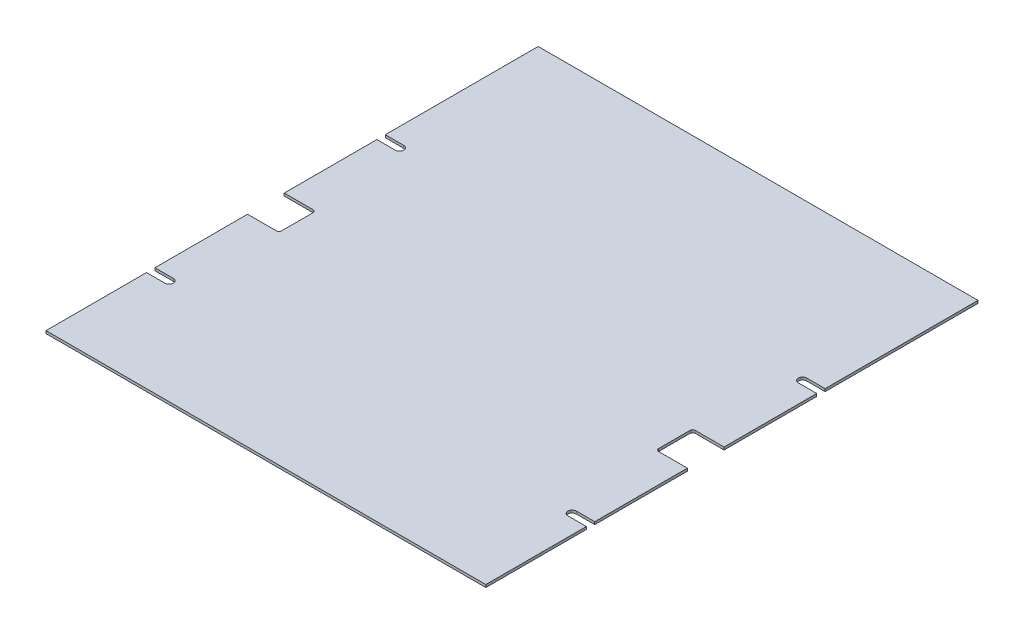
ISO-10303-21;
HEADER;
FILE_DESCRIPTION(('STEP AP214'),'2;1');
FILE_NAME('part.step','',(''),(''),'','','');
FILE_SCHEMA(('AUTOMOTIVE_DESIGN { 1 0 10303 214 1 1 1 1 }'));
ENDSEC;
DATA;
#1=APPLICATION_CONTEXT('core data for automotive mechanical design processes');
#2=APPLICATION_PROTOCOL_DEFINITION('international standard','automotive_design',2000,#1);
#3=PRODUCT_CONTEXT('',#1,'mechanical');
#4=PRODUCT('Part','Part','',(#3));
#5=PRODUCT_RELATED_PRODUCT_CATEGORY('part','',(#4));
#6=PRODUCT_DEFINITION_FORMATION('','',#4);
#7=PRODUCT_DEFINITION_CONTEXT('part definition',#1,'design');
#8=PRODUCT_DEFINITION('design','',#6,#7);
#9=PRODUCT_DEFINITION_SHAPE('','',#8);
#10=(LENGTH_UNIT() NAMED_UNIT(*) SI_UNIT(.MILLI.,.METRE.));
#11=(NAMED_UNIT(*) PLANE_ANGLE_UNIT() SI_UNIT($,.RADIAN.));
#12=(NAMED_UNIT(*) SI_UNIT($,.STERADIAN.) SOLID_ANGLE_UNIT());
#13=UNCERTAINTY_MEASURE_WITH_UNIT(LENGTH_MEASURE(1.E-05),#10,'distance_accuracy_value','');
#14=(GEOMETRIC_REPRESENTATION_CONTEXT(3) GLOBAL_UNCERTAINTY_ASSIGNED_CONTEXT((#13)) GLOBAL_UNIT_ASSIGNED_CONTEXT((#10,
#11,#12)) REPRESENTATION_CONTEXT('',''));
#15=CARTESIAN_POINT('',(0.,0.,0.));
#16=DIRECTION('',(0.,0.,1.));
#17=DIRECTION('',(1.,0.,0.));
#18=AXIS2_PLACEMENT_3D('',#15,#16,#17);
#19=CARTESIAN_POINT('',(266.7,3.175,298.45));
#20=DIRECTION('',(-1.,0.,0.));
#21=DIRECTION('',(0.,0.,1.));
#22=AXIS2_PLACEMENT_3D('',#19,#20,#21);
#23=PLANE('',#22);
#24=DIRECTION('',(0.,0.,-1.));
#25=VECTOR('',#24,1.);
#26=CARTESIAN_POINT('',(266.7,3.175,298.45));
#27=LINE('',#26,#25);
#28=CARTESIAN_POINT('',(266.7,3.175,166.370000343312));
#29=VERTEX_POINT('',#28);
#30=CARTESIAN_POINT('',(266.7,3.175,53.9749999999998));
#31=VERTEX_POINT('',#30);
#32=EDGE_CURVE('E271',#29,#31,#27,.T.);
#33=ORIENTED_EDGE('',*,*,#32,.F.);
#34=DIRECTION('',(0.,-1.,0.));
#35=VECTOR('',#34,1.);
#36=CARTESIAN_POINT('',(266.7,3.175,166.370000343312));
#37=LINE('',#36,#35);
#38=CARTESIAN_POINT('',(266.7,0.,166.370000343312));
#39=VERTEX_POINT('',#38);
#40=EDGE_CURVE('E452',#29,#39,#37,.T.);
#41=ORIENTED_EDGE('',*,*,#40,.T.);
#42=DIRECTION('',(0.,0.,-1.));
#43=VECTOR('',#42,1.);
#44=CARTESIAN_POINT('',(266.7,0.,298.45));
#45=LINE('',#44,#43);
#46=CARTESIAN_POINT('',(266.7,0.,53.9749999999998));
#47=VERTEX_POINT('',#46);
#48=EDGE_CURVE('E298',#39,#47,#45,.T.);
#49=ORIENTED_EDGE('',*,*,#48,.T.);
#50=DIRECTION('',(0.,-1.,0.));
#51=VECTOR('',#50,1.);
#52=CARTESIAN_POINT('',(266.7,3.175,53.9749999999998));
#53=LINE('',#52,#51);
#54=EDGE_CURVE('E369',#31,#47,#53,.T.);
#55=ORIENTED_EDGE('',*,*,#54,.F.);
#56=EDGE_LOOP('',(#33,#41,#49,#55));
#57=FACE_BOUND('',#56,.T.);
#58=ADVANCED_FACE('F33',(#57),#23,.F.);
#59=CARTESIAN_POINT('',(-266.7,3.175,298.45));
#60=DIRECTION('',(1.,0.,0.));
#61=DIRECTION('',(0.,0.,-1.));
#62=AXIS2_PLACEMENT_3D('',#59,#60,#61);
#63=PLANE('',#62);
#64=DIRECTION('',(0.,0.,1.));
#65=VECTOR('',#64,1.);
#66=CARTESIAN_POINT('',(-266.7,3.175,298.45));
#67=LINE('',#66,#65);
#68=CARTESIAN_POINT('',(-266.7,3.175,176.530000343312));
#69=VERTEX_POINT('',#68);
#70=CARTESIAN_POINT('',(-266.7,3.175,298.45));
#71=VERTEX_POINT('',#70);
#72=EDGE_CURVE('E282',#69,#71,#67,.T.);
#73=ORIENTED_EDGE('',*,*,#72,.F.);
#74=DIRECTION('',(0.,-1.,0.));
#75=VECTOR('',#74,1.);
#76=CARTESIAN_POINT('',(-266.7,3.175,176.530000343312));
#77=LINE('',#76,#75);
#78=CARTESIAN_POINT('',(-266.7,0.,176.530000343312));
#79=VERTEX_POINT('',#78);
#80=EDGE_CURVE('E407',#69,#79,#77,.T.);
#81=ORIENTED_EDGE('',*,*,#80,.T.);
#82=DIRECTION('',(0.,0.,1.));
#83=VECTOR('',#82,1.);
#84=CARTESIAN_POINT('',(-266.7,0.,298.45));
#85=LINE('',#84,#83);
#86=CARTESIAN_POINT('',(-266.7,0.,298.45));
#87=VERTEX_POINT('',#86);
#88=EDGE_CURVE('E300',#79,#87,#85,.T.);
#89=ORIENTED_EDGE('',*,*,#88,.T.);
#90=DIRECTION('',(0.,-1.,0.));
#91=VECTOR('',#90,1.);
#92=CARTESIAN_POINT('',(-266.7,3.175,298.45));
#93=LINE('',#92,#91);
#94=EDGE_CURVE('E309',#71,#87,#93,.T.);
#95=ORIENTED_EDGE('',*,*,#94,.F.);
#96=EDGE_LOOP('',(#73,#81,#89,#95));
#97=FACE_BOUND('',#96,.T.);
#98=ADVANCED_FACE('F521',(#97),#63,.F.);
#99=CARTESIAN_POINT('',(266.7,3.175,-113.030000343312));
#100=VERTEX_POINT('',#99);
#101=CARTESIAN_POINT('',(266.7,3.175,-298.45));
#102=VERTEX_POINT('',#101);
#103=EDGE_CURVE('E272',#100,#102,#27,.T.);
#104=ORIENTED_EDGE('',*,*,#103,.F.);
#105=DIRECTION('',(0.,-1.,0.));
#106=VECTOR('',#105,1.);
#107=CARTESIAN_POINT('',(266.7,3.175,-113.030000343312));
#108=LINE('',#107,#106);
#109=CARTESIAN_POINT('',(266.7,0.,-113.030000343312));
#110=VERTEX_POINT('',#109);
#111=EDGE_CURVE('E423',#100,#110,#108,.T.);
#112=ORIENTED_EDGE('',*,*,#111,.T.);
#113=CARTESIAN_POINT('',(266.7,0.,-298.45));
#114=VERTEX_POINT('',#113);
#115=EDGE_CURVE('E392',#110,#114,#45,.T.);
#116=ORIENTED_EDGE('',*,*,#115,.T.);
#117=DIRECTION('',(0.,-1.,0.));
#118=VECTOR('',#117,1.);
#119=CARTESIAN_POINT('',(266.7,3.175,-298.45));
#120=LINE('',#119,#118);
#121=EDGE_CURVE('E315',#102,#114,#120,.T.);
#122=ORIENTED_EDGE('',*,*,#121,.F.);
#123=EDGE_LOOP('',(#104,#112,#116,#122));
#124=FACE_BOUND('',#123,.T.);
#125=ADVANCED_FACE('F422',(#124),#23,.F.);
#126=CARTESIAN_POINT('',(-266.7,3.175,-102.870000343312));
#127=VERTEX_POINT('',#126);
#128=CARTESIAN_POINT('',(-266.7,3.175,9.52499999999975));
#129=VERTEX_POINT('',#128);
#130=EDGE_CURVE('E288',#127,#129,#67,.T.);
#131=ORIENTED_EDGE('',*,*,#130,.F.);
#132=DIRECTION('',(0.,-1.,0.));
#133=VECTOR('',#132,1.);
#134=CARTESIAN_POINT('',(-266.7,3.175,-102.870000343312));
#135=LINE('',#134,#133);
#136=CARTESIAN_POINT('',(-266.7,0.,-102.870000343312));
#137=VERTEX_POINT('',#136);
#138=EDGE_CURVE('E455',#127,#137,#135,.T.);
#139=ORIENTED_EDGE('',*,*,#138,.T.);
#140=CARTESIAN_POINT('',(-266.7,0.,9.52499999999978));
#141=VERTEX_POINT('',#140);
#142=EDGE_CURVE('E304',#137,#141,#85,.T.);
#143=ORIENTED_EDGE('',*,*,#142,.T.);
#144=DIRECTION('',(0.,-1.,0.));
#145=VECTOR('',#144,1.);
#146=CARTESIAN_POINT('',(-266.7,3.175,9.52499999999975));
#147=LINE('',#146,#145);
#148=EDGE_CURVE('E368',#129,#141,#147,.T.);
#149=ORIENTED_EDGE('',*,*,#148,.F.);
#150=EDGE_LOOP('',(#131,#139,#143,#149));
#151=FACE_BOUND('',#150,.T.);
#152=ADVANCED_FACE('F533',(#151),#63,.F.);
#153=CARTESIAN_POINT('',(266.7,0.,298.45));
#154=VERTEX_POINT('',#153);
#155=CARTESIAN_POINT('',(266.7,0.,176.530000343312));
#156=VERTEX_POINT('',#155);
#157=EDGE_CURVE('E294',#154,#156,#45,.T.);
#158=ORIENTED_EDGE('',*,*,#157,.T.);
#159=DIRECTION('',(0.,-1.,0.));
#160=VECTOR('',#159,1.);
#161=CARTESIAN_POINT('',(266.7,3.175,176.530000343312));
#162=LINE('',#161,#160);
#163=CARTESIAN_POINT('',(266.7,3.175,176.530000343312));
#164=VERTEX_POINT('',#163);
#165=EDGE_CURVE('E56',#164,#156,#162,.T.);
#166=ORIENTED_EDGE('',*,*,#165,.F.);
#167=CARTESIAN_POINT('',(266.7,3.175,298.45));
#168=VERTEX_POINT('',#167);
#169=EDGE_CURVE('E274',#168,#164,#27,.T.);
#170=ORIENTED_EDGE('',*,*,#169,.F.);
#171=DIRECTION('',(0.,-1.,0.));
#172=VECTOR('',#171,1.);
#173=CARTESIAN_POINT('',(266.7,3.175,298.45));
#174=LINE('',#173,#172);
#175=EDGE_CURVE('E293',#168,#154,#174,.T.);
#176=ORIENTED_EDGE('',*,*,#175,.T.);
#177=EDGE_LOOP('',(#158,#166,#170,#176));
#178=FACE_BOUND('',#177,.T.);
#179=ADVANCED_FACE('F559',(#178),#23,.F.);
#180=CARTESIAN_POINT('',(-266.7,0.,53.9749999999998));
#181=VERTEX_POINT('',#180);
#182=CARTESIAN_POINT('',(-266.7,0.,166.370000343312));
#183=VERTEX_POINT('',#182);
#184=EDGE_CURVE('E305',#181,#183,#85,.T.);
#185=ORIENTED_EDGE('',*,*,#184,.T.);
#186=DIRECTION('',(0.,-1.,0.));
#187=VECTOR('',#186,1.);
#188=CARTESIAN_POINT('',(-266.7,3.175,166.370000343312));
#189=LINE('',#188,#187);
#190=CARTESIAN_POINT('',(-266.7,3.175,166.370000343312));
#191=VERTEX_POINT('',#190);
#192=EDGE_CURVE('E48',#191,#183,#189,.T.);
#193=ORIENTED_EDGE('',*,*,#192,.F.);
#194=CARTESIAN_POINT('',(-266.7,3.175,53.9749999999998));
#195=VERTEX_POINT('',#194);
#196=EDGE_CURVE('E286',#195,#191,#67,.T.);
#197=ORIENTED_EDGE('',*,*,#196,.F.);
#198=DIRECTION('',(0.,-1.,0.));
#199=VECTOR('',#198,1.);
#200=CARTESIAN_POINT('',(-266.7,3.175,53.9749999999998));
#201=LINE('',#200,#199);
#202=EDGE_CURVE('E389',#195,#181,#201,.T.);
#203=ORIENTED_EDGE('',*,*,#202,.T.);
#204=EDGE_LOOP('',(#185,#193,#197,#203));
#205=FACE_BOUND('',#204,.T.);
#206=ADVANCED_FACE('F528',(#205),#63,.F.);
#207=CARTESIAN_POINT('',(266.7,0.,9.52499999999975));
#208=VERTEX_POINT('',#207);
#209=CARTESIAN_POINT('',(266.7,0.,-102.870000343312));
#210=VERTEX_POINT('',#209);
#211=EDGE_CURVE('E263',#208,#210,#45,.T.);
#212=ORIENTED_EDGE('',*,*,#211,.T.);
#213=DIRECTION('',(0.,-1.,0.));
#214=VECTOR('',#213,1.);
#215=CARTESIAN_POINT('',(266.7,3.175,-102.870000343312));
#216=LINE('',#215,#214);
#217=CARTESIAN_POINT('',(266.7,3.175,-102.870000343312));
#218=VERTEX_POINT('',#217);
#219=EDGE_CURVE('E246',#218,#210,#216,.T.);
#220=ORIENTED_EDGE('',*,*,#219,.F.);
#221=CARTESIAN_POINT('',(266.7,3.175,9.52499999999975));
#222=VERTEX_POINT('',#221);
#223=EDGE_CURVE('E261',#222,#218,#27,.T.);
#224=ORIENTED_EDGE('',*,*,#223,.F.);
#225=DIRECTION('',(0.,-1.,0.));
#226=VECTOR('',#225,1.);
#227=CARTESIAN_POINT('',(266.7,3.175,9.52499999999975));
#228=LINE('',#227,#226);
#229=EDGE_CURVE('E402',#222,#208,#228,.T.);
#230=ORIENTED_EDGE('',*,*,#229,.T.);
#231=EDGE_LOOP('',(#212,#220,#224,#230));
#232=FACE_BOUND('',#231,.T.);
#233=ADVANCED_FACE('F259',(#232),#23,.F.);
#234=CARTESIAN_POINT('',(-266.7,3.175,-298.45));
#235=DIRECTION('',(0.,0.,1.));
#236=DIRECTION('',(1.,0.,0.));
#237=AXIS2_PLACEMENT_3D('',#234,#235,#236);
#238=PLANE('',#237);
#239=DIRECTION('',(-1.,0.,0.));
#240=VECTOR('',#239,1.);
#241=CARTESIAN_POINT('',(-266.7,0.,-298.45));
#242=LINE('',#241,#240);
#243=CARTESIAN_POINT('',(-266.7,0.,-298.45));
#244=VERTEX_POINT('',#243);
#245=EDGE_CURVE('E297',#114,#244,#242,.T.);
#246=ORIENTED_EDGE('',*,*,#245,.T.);
#247=DIRECTION('',(0.,-1.,0.));
#248=VECTOR('',#247,1.);
#249=CARTESIAN_POINT('',(-266.7,3.175,-298.45));
#250=LINE('',#249,#248);
#251=CARTESIAN_POINT('',(-266.7,3.175,-298.45));
#252=VERTEX_POINT('',#251);
#253=EDGE_CURVE('E312',#252,#244,#250,.T.);
#254=ORIENTED_EDGE('',*,*,#253,.F.);
#255=DIRECTION('',(-1.,0.,0.));
#256=VECTOR('',#255,1.);
#257=CARTESIAN_POINT('',(-266.7,3.175,-298.45));
#258=LINE('',#257,#256);
#259=EDGE_CURVE('E279',#102,#252,#258,.T.);
#260=ORIENTED_EDGE('',*,*,#259,.F.);
#261=ORIENTED_EDGE('',*,*,#121,.T.);
#262=EDGE_LOOP('',(#246,#254,#260,#261));
#263=FACE_BOUND('',#262,.T.);
#264=ADVANCED_FACE('F428',(#263),#238,.F.);
#265=CARTESIAN_POINT('',(-266.7,0.,-113.030000343312));
#266=VERTEX_POINT('',#265);
#267=EDGE_CURVE('E301',#244,#266,#85,.T.);
#268=ORIENTED_EDGE('',*,*,#267,.T.);
#269=DIRECTION('',(0.,-1.,0.));
#270=VECTOR('',#269,1.);
#271=CARTESIAN_POINT('',(-266.7,3.175,-113.030000343312));
#272=LINE('',#271,#270);
#273=CARTESIAN_POINT('',(-266.7,3.175,-113.030000343312));
#274=VERTEX_POINT('',#273);
#275=EDGE_CURVE('E433',#274,#266,#272,.T.);
#276=ORIENTED_EDGE('',*,*,#275,.F.);
#277=EDGE_CURVE('E289',#252,#274,#67,.T.);
#278=ORIENTED_EDGE('',*,*,#277,.F.);
#279=ORIENTED_EDGE('',*,*,#253,.T.);
#280=EDGE_LOOP('',(#268,#276,#278,#279));
#281=FACE_BOUND('',#280,.T.);
#282=ADVANCED_FACE('F432',(#281),#63,.F.);
#283=CARTESIAN_POINT('',(-266.7,3.175,298.45));
#284=DIRECTION('',(0.,0.,-1.));
#285=DIRECTION('',(-1.,0.,0.));
#286=AXIS2_PLACEMENT_3D('',#283,#284,#285);
#287=PLANE('',#286);
#288=DIRECTION('',(1.,0.,0.));
#289=VECTOR('',#288,1.);
#290=CARTESIAN_POINT('',(-266.7,0.,298.45));
#291=LINE('',#290,#289);
#292=EDGE_CURVE('E275',#87,#154,#291,.T.);
#293=ORIENTED_EDGE('',*,*,#292,.T.);
#294=ORIENTED_EDGE('',*,*,#175,.F.);
#295=DIRECTION('',(1.,0.,0.));
#296=VECTOR('',#295,1.);
#297=CARTESIAN_POINT('',(-266.7,3.175,298.45));
#298=LINE('',#297,#296);
#299=EDGE_CURVE('E291',#71,#168,#298,.T.);
#300=ORIENTED_EDGE('',*,*,#299,.F.);
#301=ORIENTED_EDGE('',*,*,#94,.T.);
#302=EDGE_LOOP('',(#293,#294,#300,#301));
#303=FACE_BOUND('',#302,.T.);
#304=ADVANCED_FACE('F616',(#303),#287,.F.);
#305=CARTESIAN_POINT('',(0.,3.175,0.));
#306=DIRECTION('',(0.,-1.,0.));
#307=DIRECTION('',(0.,0.,-1.));
#308=AXIS2_PLACEMENT_3D('',#305,#306,#307);
#309=PLANE('',#308);
#310=CARTESIAN_POINT('',(-244.3861,3.175,-107.950000343312));
#311=DIRECTION('',(0.,-1.,0.));
#312=DIRECTION('',(0.,0.,1.));
#313=AXIS2_PLACEMENT_3D('',#310,#311,#312);
#314=CIRCLE('',#313,5.07999999999989);
#315=CARTESIAN_POINT('',(-244.386100000001,3.175,-113.030000343312));
#316=VERTEX_POINT('',#315);
#317=CARTESIAN_POINT('',(-244.386100000001,3.175,-102.870000343312));
#318=VERTEX_POINT('',#317);
#319=EDGE_CURVE('E438',#316,#318,#314,.T.);
#320=ORIENTED_EDGE('',*,*,#319,.T.);
#321=DIRECTION('',(-1.,0.,0.));
#322=VECTOR('',#321,1.);
#323=CARTESIAN_POINT('',(-266.7,3.175,-102.870000343312));
#324=LINE('',#323,#322);
#325=EDGE_CURVE('E442',#318,#127,#324,.T.);
#326=ORIENTED_EDGE('',*,*,#325,.T.);
#327=ORIENTED_EDGE('',*,*,#130,.T.);
#328=DIRECTION('',(1.,0.,0.));
#329=VECTOR('',#328,1.);
#330=CARTESIAN_POINT('',(-228.6,3.175,9.52499999999976));
#331=LINE('',#330,#329);
#332=CARTESIAN_POINT('',(-231.775,3.175,9.52499999999976));
#333=VERTEX_POINT('',#332);
#334=EDGE_CURVE('E376',#129,#333,#331,.T.);
#335=ORIENTED_EDGE('',*,*,#334,.T.);
#336=CARTESIAN_POINT('',(-231.775,3.175,12.6999999999998));
#337=DIRECTION('',(0.,-1.,0.));
#338=DIRECTION('',(0.,0.,-1.));
#339=AXIS2_PLACEMENT_3D('',#336,#337,#338);
#340=CIRCLE('',#339,3.175);
#341=CARTESIAN_POINT('',(-228.6,3.175,12.6999999999998));
#342=VERTEX_POINT('',#341);
#343=EDGE_CURVE('E11',#333,#342,#340,.T.);
#344=ORIENTED_EDGE('',*,*,#343,.T.);
#345=DIRECTION('',(0.,0.,1.));
#346=VECTOR('',#345,1.);
#347=CARTESIAN_POINT('',(-228.6,3.175,53.9749999999998));
#348=LINE('',#347,#346);
#349=CARTESIAN_POINT('',(-228.6,3.175,50.7999999999998));
#350=VERTEX_POINT('',#349);
#351=EDGE_CURVE('E374',#342,#350,#348,.T.);
#352=ORIENTED_EDGE('',*,*,#351,.T.);
#353=CARTESIAN_POINT('',(-231.775,3.175,50.7999999999998));
#354=DIRECTION('',(0.,-1.,0.));
#355=DIRECTION('',(0.,0.,-1.));
#356=AXIS2_PLACEMENT_3D('',#353,#354,#355);
#357=CIRCLE('',#356,3.175);
#358=CARTESIAN_POINT('',(-231.775,3.175,53.9749999999998));
#359=VERTEX_POINT('',#358);
#360=EDGE_CURVE('E348',#350,#359,#357,.T.);
#361=ORIENTED_EDGE('',*,*,#360,.T.);
#362=DIRECTION('',(-1.,0.,0.));
#363=VECTOR('',#362,1.);
#364=CARTESIAN_POINT('',(-228.6,3.175,53.9749999999998));
#365=LINE('',#364,#363);
#366=EDGE_CURVE('E380',#359,#195,#365,.T.);
#367=ORIENTED_EDGE('',*,*,#366,.T.);
#368=ORIENTED_EDGE('',*,*,#196,.T.);
#369=DIRECTION('',(1.,0.,0.));
#370=VECTOR('',#369,1.);
#371=CARTESIAN_POINT('',(-266.7,3.175,166.370000343312));
#372=LINE('',#371,#370);
#373=CARTESIAN_POINT('',(-244.386100000001,3.175,166.370000343312));
#374=VERTEX_POINT('',#373);
#375=EDGE_CURVE('E486',#191,#374,#372,.T.);
#376=ORIENTED_EDGE('',*,*,#375,.T.);
#377=CARTESIAN_POINT('',(-244.386100000001,3.175,171.450000343312));
#378=DIRECTION('',(0.,-1.,0.));
#379=DIRECTION('',(0.,0.,-1.));
#380=AXIS2_PLACEMENT_3D('',#377,#378,#379);
#381=CIRCLE('',#380,5.07999999999989);
#382=CARTESIAN_POINT('',(-244.386100000001,3.175,176.530000343312));
#383=VERTEX_POINT('',#382);
#384=EDGE_CURVE('E489',#374,#383,#381,.T.);
#385=ORIENTED_EDGE('',*,*,#384,.T.);
#386=DIRECTION('',(-1.,0.,0.));
#387=VECTOR('',#386,1.);
#388=CARTESIAN_POINT('',(-266.7,3.175,176.530000343312));
#389=LINE('',#388,#387);
#390=EDGE_CURVE('E493',#383,#69,#389,.T.);
#391=ORIENTED_EDGE('',*,*,#390,.T.);
#392=ORIENTED_EDGE('',*,*,#72,.T.);
#393=ORIENTED_EDGE('',*,*,#299,.T.);
#394=ORIENTED_EDGE('',*,*,#169,.T.);
#395=DIRECTION('',(-1.,0.,0.));
#396=VECTOR('',#395,1.);
#397=CARTESIAN_POINT('',(266.7,3.175,176.530000343312));
#398=LINE('',#397,#396);
#399=CARTESIAN_POINT('',(244.386100000001,3.175,176.530000343312));
#400=VERTEX_POINT('',#399);
#401=EDGE_CURVE('E464',#164,#400,#398,.T.);
#402=ORIENTED_EDGE('',*,*,#401,.T.);
#403=CARTESIAN_POINT('',(244.386100000001,3.175,171.450000343312));
#404=DIRECTION('',(0.,-1.,0.));
#405=DIRECTION('',(0.,0.,1.));
#406=AXIS2_PLACEMENT_3D('',#403,#404,#405);
#407=CIRCLE('',#406,5.07999999999983);
#408=CARTESIAN_POINT('',(244.386100000001,3.175,166.370000343312));
#409=VERTEX_POINT('',#408);
#410=EDGE_CURVE('E466',#400,#409,#407,.T.);
#411=ORIENTED_EDGE('',*,*,#410,.T.);
#412=DIRECTION('',(1.,0.,0.));
#413=VECTOR('',#412,1.);
#414=CARTESIAN_POINT('',(266.7,3.175,166.370000343312));
#415=LINE('',#414,#413);
#416=EDGE_CURVE('E470',#409,#29,#415,.T.);
#417=ORIENTED_EDGE('',*,*,#416,.T.);
#418=ORIENTED_EDGE('',*,*,#32,.T.);
#419=DIRECTION('',(-1.,0.,0.));
#420=VECTOR('',#419,1.);
#421=CARTESIAN_POINT('',(228.6,3.175,53.9749999999998));
#422=LINE('',#421,#420);
#423=CARTESIAN_POINT('',(231.775,3.175,53.9749999999998));
#424=VERTEX_POINT('',#423);
#425=EDGE_CURVE('E399',#31,#424,#422,.T.);
#426=ORIENTED_EDGE('',*,*,#425,.T.);
#427=CARTESIAN_POINT('',(231.775,3.175,50.7999999999998));
#428=DIRECTION('',(0.,-1.,0.));
#429=DIRECTION('',(0.,0.,-1.));
#430=AXIS2_PLACEMENT_3D('',#427,#428,#429);
#431=CIRCLE('',#430,3.175);
#432=CARTESIAN_POINT('',(228.6,3.175,50.7999999999998));
#433=VERTEX_POINT('',#432);
#434=EDGE_CURVE('E340',#424,#433,#431,.T.);
#435=ORIENTED_EDGE('',*,*,#434,.T.);
#436=DIRECTION('',(0.,0.,-1.));
#437=VECTOR('',#436,1.);
#438=CARTESIAN_POINT('',(228.6,3.175,53.9749999999998));
#439=LINE('',#438,#437);
#440=CARTESIAN_POINT('',(228.6,3.175,12.6999999999998));
#441=VERTEX_POINT('',#440);
#442=EDGE_CURVE('E394',#433,#441,#439,.T.);
#443=ORIENTED_EDGE('',*,*,#442,.T.);
#444=CARTESIAN_POINT('',(231.775,3.175,12.6999999999998));
#445=DIRECTION('',(0.,-1.,0.));
#446=DIRECTION('',(0.,0.,-1.));
#447=AXIS2_PLACEMENT_3D('',#444,#445,#446);
#448=CIRCLE('',#447,3.175);
#449=CARTESIAN_POINT('',(231.775,3.175,9.52499999999981));
#450=VERTEX_POINT('',#449);
#451=EDGE_CURVE('E344',#441,#450,#448,.T.);
#452=ORIENTED_EDGE('',*,*,#451,.T.);
#453=DIRECTION('',(1.,0.,0.));
#454=VECTOR('',#453,1.);
#455=CARTESIAN_POINT('',(228.6,3.175,9.52499999999981));
#456=LINE('',#455,#454);
#457=EDGE_CURVE('E269',#450,#222,#456,.T.);
#458=ORIENTED_EDGE('',*,*,#457,.T.);
#459=ORIENTED_EDGE('',*,*,#223,.T.);
#460=DIRECTION('',(-1.,0.,0.));
#461=VECTOR('',#460,1.);
#462=CARTESIAN_POINT('',(266.7,3.175,-102.870000343312));
#463=LINE('',#462,#461);
#464=CARTESIAN_POINT('',(244.386100000001,3.175,-102.870000343312));
#465=VERTEX_POINT('',#464);
#466=EDGE_CURVE('E242',#218,#465,#463,.T.);
#467=ORIENTED_EDGE('',*,*,#466,.T.);
#468=CARTESIAN_POINT('',(244.386100000001,3.175,-107.950000343312));
#469=DIRECTION('',(0.,-1.,0.));
#470=DIRECTION('',(0.,0.,-1.));
#471=AXIS2_PLACEMENT_3D('',#468,#469,#470);
#472=CIRCLE('',#471,5.07999999999983);
#473=CARTESIAN_POINT('',(244.386100000001,3.175,-113.030000343312));
#474=VERTEX_POINT('',#473);
#475=EDGE_CURVE('E253',#465,#474,#472,.T.);
#476=ORIENTED_EDGE('',*,*,#475,.T.);
#477=DIRECTION('',(1.,0.,0.));
#478=VECTOR('',#477,1.);
#479=CARTESIAN_POINT('',(266.7,3.175,-113.030000343312));
#480=LINE('',#479,#478);
#481=EDGE_CURVE('E264',#474,#100,#480,.T.);
#482=ORIENTED_EDGE('',*,*,#481,.T.);
#483=ORIENTED_EDGE('',*,*,#103,.T.);
#484=ORIENTED_EDGE('',*,*,#259,.T.);
#485=ORIENTED_EDGE('',*,*,#277,.T.);
#486=DIRECTION('',(1.,0.,0.));
#487=VECTOR('',#486,1.);
#488=CARTESIAN_POINT('',(-266.7,3.175,-113.030000343312));
#489=LINE('',#488,#487);
#490=EDGE_CURVE('E435',#274,#316,#489,.T.);
#491=ORIENTED_EDGE('',*,*,#490,.T.);
#492=EDGE_LOOP('',(#320,#326,#327,#335,#344,#352,#361,#367,#368,#376,#385,#391,#392,#393,#394,
#402,#411,#417,#418,#426,#435,#443,#452,#458,#459,#467,#476,#482,#483,#484,#485,#491));
#493=FACE_BOUND('',#492,.T.);
#494=ADVANCED_FACE('F267',(#493),#309,.F.);
#495=CARTESIAN_POINT('',(0.,0.,0.));
#496=DIRECTION('',(0.,-1.,0.));
#497=DIRECTION('',(0.,0.,-1.));
#498=AXIS2_PLACEMENT_3D('',#495,#496,#497);
#499=PLANE('',#498);
#500=DIRECTION('',(-1.,0.,0.));
#501=VECTOR('',#500,1.);
#502=CARTESIAN_POINT('',(-266.7,0.,-102.870000343312));
#503=LINE('',#502,#501);
#504=CARTESIAN_POINT('',(-244.386100000001,0.,-102.870000343312));
#505=VERTEX_POINT('',#504);
#506=EDGE_CURVE('E440',#505,#137,#503,.T.);
#507=ORIENTED_EDGE('',*,*,#506,.F.);
#508=CARTESIAN_POINT('',(-244.3861,0.,-107.950000343312));
#509=DIRECTION('',(0.,-1.,0.));
#510=DIRECTION('',(0.,0.,1.));
#511=AXIS2_PLACEMENT_3D('',#508,#509,#510);
#512=CIRCLE('',#511,5.07999999999989);
#513=CARTESIAN_POINT('',(-244.386100000001,0.,-113.030000343312));
#514=VERTEX_POINT('',#513);
#515=EDGE_CURVE('E444',#514,#505,#512,.T.);
#516=ORIENTED_EDGE('',*,*,#515,.F.);
#517=DIRECTION('',(1.,0.,0.));
#518=VECTOR('',#517,1.);
#519=CARTESIAN_POINT('',(-266.7,0.,-113.030000343312));
#520=LINE('',#519,#518);
#521=EDGE_CURVE('E449',#266,#514,#520,.T.);
#522=ORIENTED_EDGE('',*,*,#521,.F.);
#523=ORIENTED_EDGE('',*,*,#267,.F.);
#524=ORIENTED_EDGE('',*,*,#245,.F.);
#525=ORIENTED_EDGE('',*,*,#115,.F.);
#526=DIRECTION('',(1.,0.,0.));
#527=VECTOR('',#526,1.);
#528=CARTESIAN_POINT('',(266.7,0.,-113.030000343312));
#529=LINE('',#528,#527);
#530=CARTESIAN_POINT('',(244.386100000001,0.,-113.030000343312));
#531=VERTEX_POINT('',#530);
#532=EDGE_CURVE('E254',#531,#110,#529,.T.);
#533=ORIENTED_EDGE('',*,*,#532,.F.);
#534=CARTESIAN_POINT('',(244.386100000001,0.,-107.950000343312));
#535=DIRECTION('',(0.,-1.,0.));
#536=DIRECTION('',(0.,0.,-1.));
#537=AXIS2_PLACEMENT_3D('',#534,#535,#536);
#538=CIRCLE('',#537,5.07999999999983);
#539=CARTESIAN_POINT('',(244.386100000001,0.,-102.870000343312));
#540=VERTEX_POINT('',#539);
#541=EDGE_CURVE('E851',#540,#531,#538,.T.);
#542=ORIENTED_EDGE('',*,*,#541,.F.);
#543=DIRECTION('',(-1.,0.,0.));
#544=VECTOR('',#543,1.);
#545=CARTESIAN_POINT('',(266.7,0.,-102.870000343312));
#546=LINE('',#545,#544);
#547=EDGE_CURVE('E415',#210,#540,#546,.T.);
#548=ORIENTED_EDGE('',*,*,#547,.F.);
#549=ORIENTED_EDGE('',*,*,#211,.F.);
#550=DIRECTION('',(1.,0.,0.));
#551=VECTOR('',#550,1.);
#552=CARTESIAN_POINT('',(228.6,0.,9.52499999999981));
#553=LINE('',#552,#551);
#554=CARTESIAN_POINT('',(231.775,0.,9.52499999999981));
#555=VERTEX_POINT('',#554);
#556=EDGE_CURVE('E406',#555,#208,#553,.T.);
#557=ORIENTED_EDGE('',*,*,#556,.F.);
#558=CARTESIAN_POINT('',(231.775,0.,12.6999999999998));
#559=DIRECTION('',(0.,-1.,0.));
#560=DIRECTION('',(0.,0.,-1.));
#561=AXIS2_PLACEMENT_3D('',#558,#559,#560);
#562=CIRCLE('',#561,3.175);
#563=CARTESIAN_POINT('',(228.6,0.,12.6999999999998));
#564=VERTEX_POINT('',#563);
#565=EDGE_CURVE('E342',#555,#564,#562,.F.);
#566=ORIENTED_EDGE('',*,*,#565,.T.);
#567=DIRECTION('',(0.,0.,-1.));
#568=VECTOR('',#567,1.);
#569=CARTESIAN_POINT('',(228.6,0.,53.9749999999998));
#570=LINE('',#569,#568);
#571=CARTESIAN_POINT('',(228.6,0.,50.7999999999998));
#572=VERTEX_POINT('',#571);
#573=EDGE_CURVE('E403',#572,#564,#570,.T.);
#574=ORIENTED_EDGE('',*,*,#573,.F.);
#575=CARTESIAN_POINT('',(231.775,0.,50.7999999999998));
#576=DIRECTION('',(0.,-1.,0.));
#577=DIRECTION('',(0.,0.,-1.));
#578=AXIS2_PLACEMENT_3D('',#575,#576,#577);
#579=CIRCLE('',#578,3.175);
#580=CARTESIAN_POINT('',(231.775,0.,53.9749999999998));
#581=VERTEX_POINT('',#580);
#582=EDGE_CURVE('E338',#572,#581,#579,.F.);
#583=ORIENTED_EDGE('',*,*,#582,.T.);
#584=DIRECTION('',(-1.,0.,0.));
#585=VECTOR('',#584,1.);
#586=CARTESIAN_POINT('',(228.6,0.,53.9749999999998));
#587=LINE('',#586,#585);
#588=EDGE_CURVE('E397',#47,#581,#587,.T.);
#589=ORIENTED_EDGE('',*,*,#588,.F.);
#590=ORIENTED_EDGE('',*,*,#48,.F.);
#591=DIRECTION('',(1.,0.,0.));
#592=VECTOR('',#591,1.);
#593=CARTESIAN_POINT('',(266.7,0.,166.370000343312));
#594=LINE('',#593,#592);
#595=CARTESIAN_POINT('',(244.386100000001,0.,166.370000343312));
#596=VERTEX_POINT('',#595);
#597=EDGE_CURVE('E467',#596,#39,#594,.T.);
#598=ORIENTED_EDGE('',*,*,#597,.F.);
#599=CARTESIAN_POINT('',(244.386100000001,0.,171.450000343312));
#600=DIRECTION('',(0.,-1.,0.));
#601=DIRECTION('',(0.,0.,1.));
#602=AXIS2_PLACEMENT_3D('',#599,#600,#601);
#603=CIRCLE('',#602,5.07999999999983);
#604=CARTESIAN_POINT('',(244.386100000001,0.,176.530000343312));
#605=VERTEX_POINT('',#604);
#606=EDGE_CURVE('E475',#605,#596,#603,.T.);
#607=ORIENTED_EDGE('',*,*,#606,.F.);
#608=DIRECTION('',(-1.,0.,0.));
#609=VECTOR('',#608,1.);
#610=CARTESIAN_POINT('',(266.7,0.,176.530000343312));
#611=LINE('',#610,#609);
#612=EDGE_CURVE('E473',#156,#605,#611,.T.);
#613=ORIENTED_EDGE('',*,*,#612,.F.);
#614=ORIENTED_EDGE('',*,*,#157,.F.);
#615=ORIENTED_EDGE('',*,*,#292,.F.);
#616=ORIENTED_EDGE('',*,*,#88,.F.);
#617=DIRECTION('',(-1.,0.,0.));
#618=VECTOR('',#617,1.);
#619=CARTESIAN_POINT('',(-266.7,0.,176.530000343312));
#620=LINE('',#619,#618);
#621=CARTESIAN_POINT('',(-244.386100000001,0.,176.530000343312));
#622=VERTEX_POINT('',#621);
#623=EDGE_CURVE('E490',#622,#79,#620,.T.);
#624=ORIENTED_EDGE('',*,*,#623,.F.);
#625=CARTESIAN_POINT('',(-244.386100000001,0.,171.450000343312));
#626=DIRECTION('',(0.,-1.,0.));
#627=DIRECTION('',(0.,0.,-1.));
#628=AXIS2_PLACEMENT_3D('',#625,#626,#627);
#629=CIRCLE('',#628,5.07999999999989);
#630=CARTESIAN_POINT('',(-244.386100000001,0.,166.370000343312));
#631=VERTEX_POINT('',#630);
#632=EDGE_CURVE('E497',#631,#622,#629,.T.);
#633=ORIENTED_EDGE('',*,*,#632,.F.);
#634=DIRECTION('',(1.,0.,0.));
#635=VECTOR('',#634,1.);
#636=CARTESIAN_POINT('',(-266.7,0.,166.370000343312));
#637=LINE('',#636,#635);
#638=EDGE_CURVE('E458',#183,#631,#637,.T.);
#639=ORIENTED_EDGE('',*,*,#638,.F.);
#640=ORIENTED_EDGE('',*,*,#184,.F.);
#641=DIRECTION('',(-1.,0.,0.));
#642=VECTOR('',#641,1.);
#643=CARTESIAN_POINT('',(-228.6,0.,53.9749999999998));
#644=LINE('',#643,#642);
#645=CARTESIAN_POINT('',(-231.775,0.,53.9749999999998));
#646=VERTEX_POINT('',#645);
#647=EDGE_CURVE('E383',#646,#181,#644,.T.);
#648=ORIENTED_EDGE('',*,*,#647,.F.);
#649=CARTESIAN_POINT('',(-231.775,0.,50.7999999999998));
#650=DIRECTION('',(0.,-1.,0.));
#651=DIRECTION('',(0.,0.,-1.));
#652=AXIS2_PLACEMENT_3D('',#649,#650,#651);
#653=CIRCLE('',#652,3.175);
#654=CARTESIAN_POINT('',(-228.6,0.,50.7999999999998));
#655=VERTEX_POINT('',#654);
#656=EDGE_CURVE('E346',#646,#655,#653,.F.);
#657=ORIENTED_EDGE('',*,*,#656,.T.);
#658=DIRECTION('',(0.,0.,1.));
#659=VECTOR('',#658,1.);
#660=CARTESIAN_POINT('',(-228.6,0.,53.9749999999998));
#661=LINE('',#660,#659);
#662=CARTESIAN_POINT('',(-228.6,0.,12.6999999999998));
#663=VERTEX_POINT('',#662);
#664=EDGE_CURVE('E358',#663,#655,#661,.T.);
#665=ORIENTED_EDGE('',*,*,#664,.F.);
#666=CARTESIAN_POINT('',(-231.775,0.,12.6999999999998));
#667=DIRECTION('',(0.,-1.,0.));
#668=DIRECTION('',(0.,0.,-1.));
#669=AXIS2_PLACEMENT_3D('',#666,#667,#668);
#670=CIRCLE('',#669,3.175);
#671=CARTESIAN_POINT('',(-231.775,0.,9.52499999999976));
#672=VERTEX_POINT('',#671);
#673=EDGE_CURVE('E41',#663,#672,#670,.F.);
#674=ORIENTED_EDGE('',*,*,#673,.T.);
#675=DIRECTION('',(1.,0.,0.));
#676=VECTOR('',#675,1.);
#677=CARTESIAN_POINT('',(-228.6,0.,9.52499999999976));
#678=LINE('',#677,#676);
#679=EDGE_CURVE('E356',#141,#672,#678,.T.);
#680=ORIENTED_EDGE('',*,*,#679,.F.);
#681=ORIENTED_EDGE('',*,*,#142,.F.);
#682=EDGE_LOOP('',(#507,#516,#522,#523,#524,#525,#533,#542,#548,#549,#557,#566,#574,#583,#589,
#590,#598,#607,#613,#614,#615,#616,#624,#633,#639,#640,#648,#657,#665,#674,#680,#681));
#683=FACE_BOUND('',#682,.T.);
#684=ADVANCED_FACE('F354',(#683),#499,.T.);
#685=CARTESIAN_POINT('',(228.6,3.175,53.9749999999998));
#686=DIRECTION('',(-1.,0.,0.));
#687=DIRECTION('',(0.,0.,1.));
#688=AXIS2_PLACEMENT_3D('',#685,#686,#687);
#689=PLANE('',#688);
#690=ORIENTED_EDGE('',*,*,#442,.F.);
#691=DIRECTION('',(0.,-1.,0.));
#692=VECTOR('',#691,1.);
#693=CARTESIAN_POINT('',(228.6,0.,50.7999999999998));
#694=LINE('',#693,#692);
#695=EDGE_CURVE('E320',#433,#572,#694,.T.);
#696=ORIENTED_EDGE('',*,*,#695,.T.);
#697=ORIENTED_EDGE('',*,*,#573,.T.);
#698=DIRECTION('',(0.,-1.,0.));
#699=VECTOR('',#698,1.);
#700=CARTESIAN_POINT('',(228.6,3.175,12.6999999999998));
#701=LINE('',#700,#699);
#702=EDGE_CURVE('E318',#564,#441,#701,.F.);
#703=ORIENTED_EDGE('',*,*,#702,.T.);
#704=EDGE_LOOP('',(#690,#696,#697,#703));
#705=FACE_BOUND('',#704,.T.);
#706=ADVANCED_FACE('F593',(#705),#689,.F.);
#707=CARTESIAN_POINT('',(228.6,3.175,53.9749999999998));
#708=DIRECTION('',(0.,0.,1.));
#709=DIRECTION('',(1.,0.,0.));
#710=AXIS2_PLACEMENT_3D('',#707,#708,#709);
#711=PLANE('',#710);
#712=ORIENTED_EDGE('',*,*,#588,.T.);
#713=DIRECTION('',(0.,-1.,0.));
#714=VECTOR('',#713,1.);
#715=CARTESIAN_POINT('',(231.775,3.175,53.9749999999998));
#716=LINE('',#715,#714);
#717=EDGE_CURVE('E323',#581,#424,#716,.F.);
#718=ORIENTED_EDGE('',*,*,#717,.T.);
#719=ORIENTED_EDGE('',*,*,#425,.F.);
#720=ORIENTED_EDGE('',*,*,#54,.T.);
#721=EDGE_LOOP('',(#712,#718,#719,#720));
#722=FACE_BOUND('',#721,.T.);
#723=ADVANCED_FACE('F584',(#722),#711,.F.);
#724=CARTESIAN_POINT('',(228.6,3.175,9.52499999999981));
#725=DIRECTION('',(0.,0.,-1.));
#726=DIRECTION('',(-1.,0.,0.));
#727=AXIS2_PLACEMENT_3D('',#724,#725,#726);
#728=PLANE('',#727);
#729=ORIENTED_EDGE('',*,*,#457,.F.);
#730=DIRECTION('',(0.,-1.,0.));
#731=VECTOR('',#730,1.);
#732=CARTESIAN_POINT('',(231.775,0.,9.52499999999981));
#733=LINE('',#732,#731);
#734=EDGE_CURVE('E325',#450,#555,#733,.T.);
#735=ORIENTED_EDGE('',*,*,#734,.T.);
#736=ORIENTED_EDGE('',*,*,#556,.T.);
#737=ORIENTED_EDGE('',*,*,#229,.F.);
#738=EDGE_LOOP('',(#729,#735,#736,#737));
#739=FACE_BOUND('',#738,.T.);
#740=ADVANCED_FACE('F599',(#739),#728,.F.);
#741=CARTESIAN_POINT('',(-228.6,3.175,53.9749999999998));
#742=DIRECTION('',(0.,0.,1.));
#743=DIRECTION('',(1.,0.,0.));
#744=AXIS2_PLACEMENT_3D('',#741,#742,#743);
#745=PLANE('',#744);
#746=ORIENTED_EDGE('',*,*,#366,.F.);
#747=DIRECTION('',(0.,-1.,0.));
#748=VECTOR('',#747,1.);
#749=CARTESIAN_POINT('',(-231.775,0.,53.9749999999998));
#750=LINE('',#749,#748);
#751=EDGE_CURVE('E328',#359,#646,#750,.T.);
#752=ORIENTED_EDGE('',*,*,#751,.T.);
#753=ORIENTED_EDGE('',*,*,#647,.T.);
#754=ORIENTED_EDGE('',*,*,#202,.F.);
#755=EDGE_LOOP('',(#746,#752,#753,#754));
#756=FACE_BOUND('',#755,.T.);
#757=ADVANCED_FACE('F601',(#756),#745,.F.);
#758=CARTESIAN_POINT('',(-228.6,3.175,53.9749999999998));
#759=DIRECTION('',(1.,0.,0.));
#760=DIRECTION('',(0.,0.,-1.));
#761=AXIS2_PLACEMENT_3D('',#758,#759,#760);
#762=PLANE('',#761);
#763=ORIENTED_EDGE('',*,*,#664,.T.);
#764=DIRECTION('',(0.,-1.,0.));
#765=VECTOR('',#764,1.);
#766=CARTESIAN_POINT('',(-228.6,3.175,50.7999999999998));
#767=LINE('',#766,#765);
#768=EDGE_CURVE('E334',#655,#350,#767,.F.);
#769=ORIENTED_EDGE('',*,*,#768,.T.);
#770=ORIENTED_EDGE('',*,*,#351,.F.);
#771=DIRECTION('',(0.,-1.,0.));
#772=VECTOR('',#771,1.);
#773=CARTESIAN_POINT('',(-228.6,0.,12.6999999999998));
#774=LINE('',#773,#772);
#775=EDGE_CURVE('E331',#342,#663,#774,.T.);
#776=ORIENTED_EDGE('',*,*,#775,.T.);
#777=EDGE_LOOP('',(#763,#769,#770,#776));
#778=FACE_BOUND('',#777,.T.);
#779=ADVANCED_FACE('F378',(#778),#762,.F.);
#780=CARTESIAN_POINT('',(-228.6,3.175,9.52499999999976));
#781=DIRECTION('',(0.,0.,-1.));
#782=DIRECTION('',(-1.,0.,0.));
#783=AXIS2_PLACEMENT_3D('',#780,#781,#782);
#784=PLANE('',#783);
#785=ORIENTED_EDGE('',*,*,#679,.T.);
#786=DIRECTION('',(0.,-1.,0.));
#787=VECTOR('',#786,1.);
#788=CARTESIAN_POINT('',(-231.775,3.175,9.52499999999976));
#789=LINE('',#788,#787);
#790=EDGE_CURVE('E336',#672,#333,#789,.F.);
#791=ORIENTED_EDGE('',*,*,#790,.T.);
#792=ORIENTED_EDGE('',*,*,#334,.F.);
#793=ORIENTED_EDGE('',*,*,#148,.T.);
#794=EDGE_LOOP('',(#785,#791,#792,#793));
#795=FACE_BOUND('',#794,.T.);
#796=ADVANCED_FACE('F364',(#795),#784,.F.);
#797=CARTESIAN_POINT('',(231.775,3.175,50.7999999999998));
#798=DIRECTION('',(0.,1.,0.));
#799=DIRECTION('',(0.,0.,1.));
#800=AXIS2_PLACEMENT_3D('',#797,#798,#799);
#801=CYLINDRICAL_SURFACE('',#800,3.175);
#802=ORIENTED_EDGE('',*,*,#434,.F.);
#803=ORIENTED_EDGE('',*,*,#717,.F.);
#804=ORIENTED_EDGE('',*,*,#582,.F.);
#805=ORIENTED_EDGE('',*,*,#695,.F.);
#806=EDGE_LOOP('',(#802,#803,#804,#805));
#807=FACE_BOUND('',#806,.T.);
#808=ADVANCED_FACE('F590',(#807),#801,.F.);
#809=CARTESIAN_POINT('',(231.775,3.175,12.6999999999998));
#810=DIRECTION('',(0.,1.,0.));
#811=DIRECTION('',(0.,0.,1.));
#812=AXIS2_PLACEMENT_3D('',#809,#810,#811);
#813=CYLINDRICAL_SURFACE('',#812,3.175);
#814=ORIENTED_EDGE('',*,*,#451,.F.);
#815=ORIENTED_EDGE('',*,*,#702,.F.);
#816=ORIENTED_EDGE('',*,*,#565,.F.);
#817=ORIENTED_EDGE('',*,*,#734,.F.);
#818=EDGE_LOOP('',(#814,#815,#816,#817));
#819=FACE_BOUND('',#818,.T.);
#820=ADVANCED_FACE('F598',(#819),#813,.F.);
#821=CARTESIAN_POINT('',(-231.775,3.175,50.7999999999998));
#822=DIRECTION('',(0.,1.,0.));
#823=DIRECTION('',(0.,0.,1.));
#824=AXIS2_PLACEMENT_3D('',#821,#822,#823);
#825=CYLINDRICAL_SURFACE('',#824,3.175);
#826=ORIENTED_EDGE('',*,*,#360,.F.);
#827=ORIENTED_EDGE('',*,*,#768,.F.);
#828=ORIENTED_EDGE('',*,*,#656,.F.);
#829=ORIENTED_EDGE('',*,*,#751,.F.);
#830=EDGE_LOOP('',(#826,#827,#828,#829));
#831=FACE_BOUND('',#830,.T.);
#832=ADVANCED_FACE('F688',(#831),#825,.F.);
#833=CARTESIAN_POINT('',(-231.775,3.175,12.6999999999998));
#834=DIRECTION('',(0.,1.,0.));
#835=DIRECTION('',(0.,0.,1.));
#836=AXIS2_PLACEMENT_3D('',#833,#834,#835);
#837=CYLINDRICAL_SURFACE('',#836,3.175);
#838=ORIENTED_EDGE('',*,*,#343,.F.);
#839=ORIENTED_EDGE('',*,*,#790,.F.);
#840=ORIENTED_EDGE('',*,*,#673,.F.);
#841=ORIENTED_EDGE('',*,*,#775,.F.);
#842=EDGE_LOOP('',(#838,#839,#840,#841));
#843=FACE_BOUND('',#842,.T.);
#844=ADVANCED_FACE('F35',(#843),#837,.F.);
#845=CARTESIAN_POINT('',(-266.7,3.175,176.530000343312));
#846=DIRECTION('',(0.,0.,1.));
#847=DIRECTION('',(1.,0.,0.));
#848=AXIS2_PLACEMENT_3D('',#845,#846,#847);
#849=PLANE('',#848);
#850=ORIENTED_EDGE('',*,*,#623,.T.);
#851=ORIENTED_EDGE('',*,*,#80,.F.);
#852=ORIENTED_EDGE('',*,*,#390,.F.);
#853=DIRECTION('',(0.,-1.,0.));
#854=VECTOR('',#853,1.);
#855=CARTESIAN_POINT('',(-244.386100000001,3.175,176.530000343312));
#856=LINE('',#855,#854);
#857=EDGE_CURVE('E503',#383,#622,#856,.T.);
#858=ORIENTED_EDGE('',*,*,#857,.T.);
#859=EDGE_LOOP('',(#850,#851,#852,#858));
#860=FACE_BOUND('',#859,.T.);
#861=ADVANCED_FACE('F517',(#860),#849,.F.);
#862=CARTESIAN_POINT('',(-244.386100000001,3.175,171.450000343312));
#863=DIRECTION('',(0.,-1.,0.));
#864=DIRECTION('',(0.,0.,-1.));
#865=AXIS2_PLACEMENT_3D('',#862,#863,#864);
#866=CYLINDRICAL_SURFACE('',#865,5.07999999999989);
#867=ORIENTED_EDGE('',*,*,#632,.T.);
#868=ORIENTED_EDGE('',*,*,#857,.F.);
#869=ORIENTED_EDGE('',*,*,#384,.F.);
#870=DIRECTION('',(0.,-1.,0.));
#871=VECTOR('',#870,1.);
#872=CARTESIAN_POINT('',(-244.386100000001,3.175,166.370000343312));
#873=LINE('',#872,#871);
#874=EDGE_CURVE('E505',#374,#631,#873,.T.);
#875=ORIENTED_EDGE('',*,*,#874,.T.);
#876=EDGE_LOOP('',(#867,#868,#869,#875));
#877=FACE_BOUND('',#876,.T.);
#878=ADVANCED_FACE('F508',(#877),#866,.F.);
#879=CARTESIAN_POINT('',(-266.7,3.175,166.370000343312));
#880=DIRECTION('',(0.,0.,-1.));
#881=DIRECTION('',(-1.,0.,0.));
#882=AXIS2_PLACEMENT_3D('',#879,#880,#881);
#883=PLANE('',#882);
#884=ORIENTED_EDGE('',*,*,#638,.T.);
#885=ORIENTED_EDGE('',*,*,#874,.F.);
#886=ORIENTED_EDGE('',*,*,#375,.F.);
#887=ORIENTED_EDGE('',*,*,#192,.T.);
#888=EDGE_LOOP('',(#884,#885,#886,#887));
#889=FACE_BOUND('',#888,.T.);
#890=ADVANCED_FACE('F511',(#889),#883,.F.);
#891=CARTESIAN_POINT('',(266.7,3.175,-113.030000343312));
#892=DIRECTION('',(0.,0.,-1.));
#893=DIRECTION('',(-1.,0.,0.));
#894=AXIS2_PLACEMENT_3D('',#891,#892,#893);
#895=PLANE('',#894);
#896=ORIENTED_EDGE('',*,*,#532,.T.);
#897=ORIENTED_EDGE('',*,*,#111,.F.);
#898=ORIENTED_EDGE('',*,*,#481,.F.);
#899=DIRECTION('',(0.,-1.,0.));
#900=VECTOR('',#899,1.);
#901=CARTESIAN_POINT('',(244.386100000001,3.175,-113.030000343312));
#902=LINE('',#901,#900);
#903=EDGE_CURVE('E852',#474,#531,#902,.T.);
#904=ORIENTED_EDGE('',*,*,#903,.T.);
#905=EDGE_LOOP('',(#896,#897,#898,#904));
#906=FACE_BOUND('',#905,.T.);
#907=ADVANCED_FACE('F776',(#906),#895,.F.);
#908=CARTESIAN_POINT('',(244.386100000001,3.175,-107.950000343312));
#909=DIRECTION('',(0.,-1.,0.));
#910=DIRECTION('',(0.,0.,-1.));
#911=AXIS2_PLACEMENT_3D('',#908,#909,#910);
#912=CYLINDRICAL_SURFACE('',#911,5.07999999999983);
#913=ORIENTED_EDGE('',*,*,#541,.T.);
#914=ORIENTED_EDGE('',*,*,#903,.F.);
#915=ORIENTED_EDGE('',*,*,#475,.F.);
#916=DIRECTION('',(0.,-1.,0.));
#917=VECTOR('',#916,1.);
#918=CARTESIAN_POINT('',(244.386100000001,3.175,-102.870000343312));
#919=LINE('',#918,#917);
#920=EDGE_CURVE('E248',#465,#540,#919,.T.);
#921=ORIENTED_EDGE('',*,*,#920,.T.);
#922=EDGE_LOOP('',(#913,#914,#915,#921));
#923=FACE_BOUND('',#922,.T.);
#924=ADVANCED_FACE('F784',(#923),#912,.F.);
#925=CARTESIAN_POINT('',(266.7,3.175,-102.870000343312));
#926=DIRECTION('',(0.,0.,1.));
#927=DIRECTION('',(1.,0.,0.));
#928=AXIS2_PLACEMENT_3D('',#925,#926,#927);
#929=PLANE('',#928);
#930=ORIENTED_EDGE('',*,*,#547,.T.);
#931=ORIENTED_EDGE('',*,*,#920,.F.);
#932=ORIENTED_EDGE('',*,*,#466,.F.);
#933=ORIENTED_EDGE('',*,*,#219,.T.);
#934=EDGE_LOOP('',(#930,#931,#932,#933));
#935=FACE_BOUND('',#934,.T.);
#936=ADVANCED_FACE('F245',(#935),#929,.F.);
#937=CARTESIAN_POINT('',(266.7,3.175,166.370000343312));
#938=DIRECTION('',(0.,0.,-1.));
#939=DIRECTION('',(-1.,0.,0.));
#940=AXIS2_PLACEMENT_3D('',#937,#938,#939);
#941=PLANE('',#940);
#942=ORIENTED_EDGE('',*,*,#597,.T.);
#943=ORIENTED_EDGE('',*,*,#40,.F.);
#944=ORIENTED_EDGE('',*,*,#416,.F.);
#945=DIRECTION('',(0.,-1.,0.));
#946=VECTOR('',#945,1.);
#947=CARTESIAN_POINT('',(244.386100000001,3.175,166.370000343312));
#948=LINE('',#947,#946);
#949=EDGE_CURVE('E481',#409,#596,#948,.T.);
#950=ORIENTED_EDGE('',*,*,#949,.T.);
#951=EDGE_LOOP('',(#942,#943,#944,#950));
#952=FACE_BOUND('',#951,.T.);
#953=ADVANCED_FACE('F801',(#952),#941,.F.);
#954=CARTESIAN_POINT('',(244.386100000001,3.175,171.450000343312));
#955=DIRECTION('',(0.,-1.,0.));
#956=DIRECTION('',(0.,0.,-1.));
#957=AXIS2_PLACEMENT_3D('',#954,#955,#956);
#958=CYLINDRICAL_SURFACE('',#957,5.07999999999983);
#959=ORIENTED_EDGE('',*,*,#606,.T.);
#960=ORIENTED_EDGE('',*,*,#949,.F.);
#961=ORIENTED_EDGE('',*,*,#410,.F.);
#962=DIRECTION('',(0.,-1.,0.));
#963=VECTOR('',#962,1.);
#964=CARTESIAN_POINT('',(244.386100000001,3.175,176.530000343312));
#965=LINE('',#964,#963);
#966=EDGE_CURVE('E483',#400,#605,#965,.T.);
#967=ORIENTED_EDGE('',*,*,#966,.T.);
#968=EDGE_LOOP('',(#959,#960,#961,#967));
#969=FACE_BOUND('',#968,.T.);
#970=ADVANCED_FACE('F576',(#969),#958,.F.);
#971=CARTESIAN_POINT('',(266.7,3.175,176.530000343312));
#972=DIRECTION('',(0.,0.,1.));
#973=DIRECTION('',(1.,0.,0.));
#974=AXIS2_PLACEMENT_3D('',#971,#972,#973);
#975=PLANE('',#974);
#976=ORIENTED_EDGE('',*,*,#612,.T.);
#977=ORIENTED_EDGE('',*,*,#966,.F.);
#978=ORIENTED_EDGE('',*,*,#401,.F.);
#979=ORIENTED_EDGE('',*,*,#165,.T.);
#980=EDGE_LOOP('',(#976,#977,#978,#979));
#981=FACE_BOUND('',#980,.T.);
#982=ADVANCED_FACE('F573',(#981),#975,.F.);
#983=CARTESIAN_POINT('',(-266.7,3.175,-102.870000343312));
#984=DIRECTION('',(0.,0.,1.));
#985=DIRECTION('',(1.,0.,0.));
#986=AXIS2_PLACEMENT_3D('',#983,#984,#985);
#987=PLANE('',#986);
#988=ORIENTED_EDGE('',*,*,#506,.T.);
#989=ORIENTED_EDGE('',*,*,#138,.F.);
#990=ORIENTED_EDGE('',*,*,#325,.F.);
#991=DIRECTION('',(0.,-1.,0.));
#992=VECTOR('',#991,1.);
#993=CARTESIAN_POINT('',(-244.386100000001,3.175,-102.870000343312));
#994=LINE('',#993,#992);
#995=EDGE_CURVE('E459',#318,#505,#994,.T.);
#996=ORIENTED_EDGE('',*,*,#995,.T.);
#997=EDGE_LOOP('',(#988,#989,#990,#996));
#998=FACE_BOUND('',#997,.T.);
#999=ADVANCED_FACE('F536',(#998),#987,.F.);
#1000=CARTESIAN_POINT('',(-244.3861,3.175,-107.950000343312));
#1001=DIRECTION('',(0.,-1.,0.));
#1002=DIRECTION('',(0.,0.,-1.));
#1003=AXIS2_PLACEMENT_3D('',#1000,#1001,#1002);
#1004=CYLINDRICAL_SURFACE('',#1003,5.07999999999989);
#1005=ORIENTED_EDGE('',*,*,#515,.T.);
#1006=ORIENTED_EDGE('',*,*,#995,.F.);
#1007=ORIENTED_EDGE('',*,*,#319,.F.);
#1008=DIRECTION('',(0.,-1.,0.));
#1009=VECTOR('',#1008,1.);
#1010=CARTESIAN_POINT('',(-244.386100000001,3.175,-113.030000343312));
#1011=LINE('',#1010,#1009);
#1012=EDGE_CURVE('E461',#316,#514,#1011,.T.);
#1013=ORIENTED_EDGE('',*,*,#1012,.T.);
#1014=EDGE_LOOP('',(#1005,#1006,#1007,#1013));
#1015=FACE_BOUND('',#1014,.T.);
#1016=ADVANCED_FACE('F539',(#1015),#1004,.F.);
#1017=CARTESIAN_POINT('',(-266.7,3.175,-113.030000343312));
#1018=DIRECTION('',(0.,0.,-1.));
#1019=DIRECTION('',(-1.,0.,0.));
#1020=AXIS2_PLACEMENT_3D('',#1017,#1018,#1019);
#1021=PLANE('',#1020);
#1022=ORIENTED_EDGE('',*,*,#521,.T.);
#1023=ORIENTED_EDGE('',*,*,#1012,.F.);
#1024=ORIENTED_EDGE('',*,*,#490,.F.);
#1025=ORIENTED_EDGE('',*,*,#275,.T.);
#1026=EDGE_LOOP('',(#1022,#1023,#1024,#1025));
#1027=FACE_BOUND('',#1026,.T.);
#1028=ADVANCED_FACE('F540',(#1027),#1021,.F.);
#1029=CLOSED_SHELL('',(#58,#98,#125,#152,#179,#206,#233,#264,#282,#304,#494,#684,#706,#723,#740,
#757,#779,#796,#808,#820,#832,#844,#861,#878,#890,#907,#924,#936,#953,#970,#982,#999,#1016,#1028));
#1030=MANIFOLD_SOLID_BREP('B2',#1029);
#1031=ADVANCED_BREP_SHAPE_REPRESENTATION('',(#18,#1030),#14);
#1032=SHAPE_DEFINITION_REPRESENTATION(#9,#1031);
ENDSEC;
END-ISO-10303-21;
